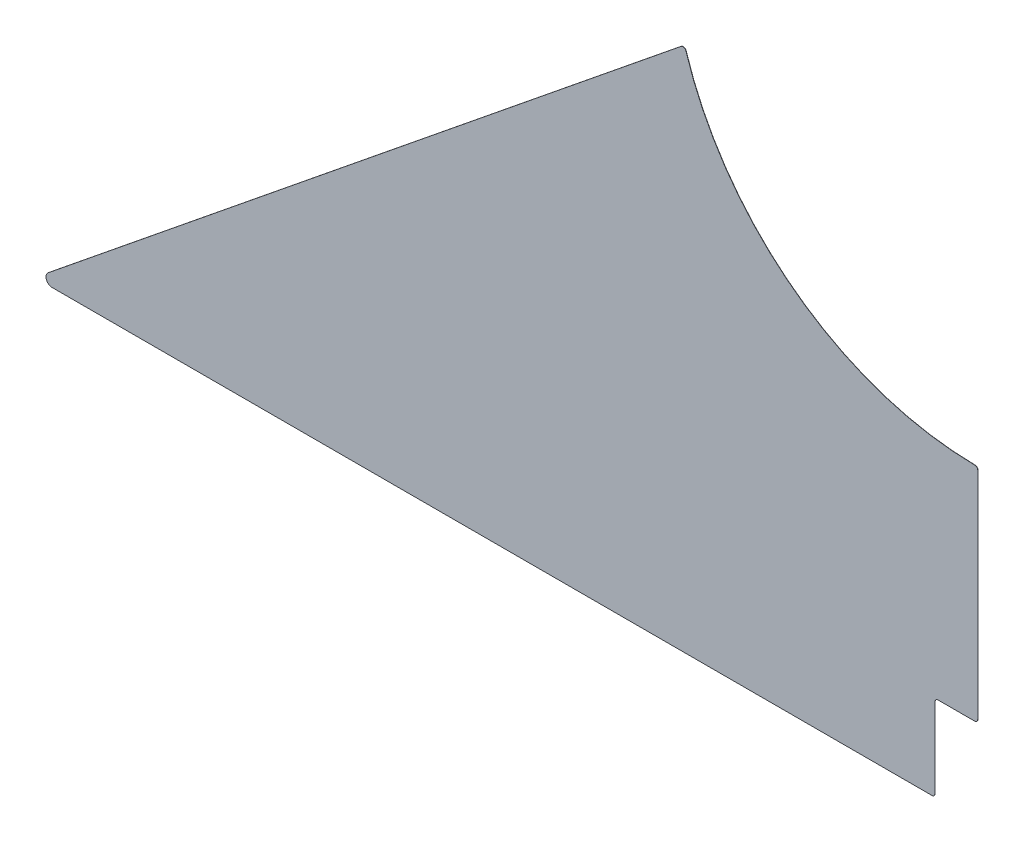
ISO-10303-21;
HEADER;
FILE_DESCRIPTION(('STEP AP214'),'2;1');
FILE_NAME('part.step','',(''),(''),'','','');
FILE_SCHEMA(('AUTOMOTIVE_DESIGN { 1 0 10303 214 1 1 1 1 }'));
ENDSEC;
DATA;
#1=APPLICATION_CONTEXT('core data for automotive mechanical design processes');
#2=APPLICATION_PROTOCOL_DEFINITION('international standard','automotive_design',2000,#1);
#3=PRODUCT_CONTEXT('',#1,'mechanical');
#4=PRODUCT('Part','Part','',(#3));
#5=PRODUCT_RELATED_PRODUCT_CATEGORY('part','',(#4));
#6=PRODUCT_DEFINITION_FORMATION('','',#4);
#7=PRODUCT_DEFINITION_CONTEXT('part definition',#1,'design');
#8=PRODUCT_DEFINITION('design','',#6,#7);
#9=PRODUCT_DEFINITION_SHAPE('','',#8);
#10=(LENGTH_UNIT() NAMED_UNIT(*) SI_UNIT(.MILLI.,.METRE.));
#11=(NAMED_UNIT(*) PLANE_ANGLE_UNIT() SI_UNIT($,.RADIAN.));
#12=(NAMED_UNIT(*) SI_UNIT($,.STERADIAN.) SOLID_ANGLE_UNIT());
#13=UNCERTAINTY_MEASURE_WITH_UNIT(LENGTH_MEASURE(1.E-05),#10,'distance_accuracy_value','');
#14=(GEOMETRIC_REPRESENTATION_CONTEXT(3) GLOBAL_UNCERTAINTY_ASSIGNED_CONTEXT((#13)) GLOBAL_UNIT_ASSIGNED_CONTEXT((#10,
#11,#12)) REPRESENTATION_CONTEXT('',''));
#15=CARTESIAN_POINT('',(0.,0.,0.));
#16=DIRECTION('',(0.,0.,1.));
#17=DIRECTION('',(1.,0.,0.));
#18=AXIS2_PLACEMENT_3D('',#15,#16,#17);
#19=CARTESIAN_POINT('',(-1292.225,-3.17670318081826E-13,1.5875));
#20=DIRECTION('',(0.629320391049834,-0.777145961456974,0.));
#21=DIRECTION('',(0.777145961456974,0.629320391049834,0.));
#22=AXIS2_PLACEMENT_3D('',#19,#20,#21);
#23=PLANE('',#22);
#24=DIRECTION('',(0.,0.,-1.));
#25=VECTOR('',#24,1.);
#26=CARTESIAN_POINT('',(-307.961691260842,797.04071187665,1.5875));
#27=LINE('',#26,#25);
#28=CARTESIAN_POINT('',(-307.961691260842,797.04071187665,1.5875));
#29=VERTEX_POINT('',#28);
#30=CARTESIAN_POINT('',(-307.961691260842,797.04071187665,1.3335));
#31=VERTEX_POINT('',#30);
#32=EDGE_CURVE('E177',#29,#31,#27,.T.);
#33=ORIENTED_EDGE('',*,*,#32,.T.);
#34=DIRECTION('',(-0.777145961456974,-0.629320391049834,0.));
#35=VECTOR('',#34,1.);
#36=CARTESIAN_POINT('',(-1292.225,-3.17658004608335E-13,1.3334999999999));
#37=LINE('',#36,#35);
#38=CARTESIAN_POINT('',(-964.74529205127,265.187838692242,1.33349999999993));
#39=VERTEX_POINT('',#38);
#40=EDGE_CURVE('E194',#31,#39,#37,.T.);
#41=ORIENTED_EDGE('',*,*,#40,.T.);
#42=DIRECTION('',(0.,0.,1.));
#43=VECTOR('',#42,1.);
#44=CARTESIAN_POINT('',(-964.74529205127,265.187838692242,1.5875));
#45=LINE('',#44,#43);
#46=CARTESIAN_POINT('',(-964.74529205127,265.187838692242,1.5875));
#47=VERTEX_POINT('',#46);
#48=EDGE_CURVE('E60',#39,#47,#45,.T.);
#49=ORIENTED_EDGE('',*,*,#48,.T.);
#50=DIRECTION('',(-0.777145961456974,-0.629320391049834,0.));
#51=VECTOR('',#50,1.);
#52=CARTESIAN_POINT('',(-1292.225,-3.17670318081826E-13,1.5875));
#53=LINE('',#52,#51);
#54=EDGE_CURVE('E222',#29,#47,#53,.T.);
#55=ORIENTED_EDGE('',*,*,#54,.F.);
#56=EDGE_LOOP('',(#33,#41,#49,#55));
#57=FACE_BOUND('',#56,.T.);
#58=ADVANCED_FACE('F37',(#57),#23,.F.);
#59=CARTESIAN_POINT('',(0.,890.5875,1.5875));
#60=DIRECTION('',(0.,0.,-1.));
#61=DIRECTION('',(-1.,0.,0.));
#62=AXIS2_PLACEMENT_3D('',#59,#60,#61);
#63=CYLINDRICAL_SURFACE('',#62,317.5);
#64=DIRECTION('',(0.,0.,-1.));
#65=VECTOR('',#64,1.);
#66=CARTESIAN_POINT('',(-3.14356435643564,573.103062581192,1.5875));
#67=LINE('',#66,#65);
#68=CARTESIAN_POINT('',(-3.14356435643564,573.103062581192,1.5875));
#69=VERTEX_POINT('',#68);
#70=CARTESIAN_POINT('',(-3.14356435643564,573.103062581192,1.33349999999997));
#71=VERTEX_POINT('',#70);
#72=EDGE_CURVE('E157',#69,#71,#67,.T.);
#73=ORIENTED_EDGE('',*,*,#72,.T.);
#74=CARTESIAN_POINT('',(0.,890.5875,1.33350000000001));
#75=DIRECTION('',(0.,0.,1.));
#76=DIRECTION('',(0.,-1.,0.));
#77=AXIS2_PLACEMENT_3D('',#74,#75,#76);
#78=CIRCLE('',#77,317.5);
#79=CARTESIAN_POINT('',(-302.934256454712,795.523909355469,1.3335));
#80=VERTEX_POINT('',#79);
#81=EDGE_CURVE('E133',#71,#80,#78,.F.);
#82=ORIENTED_EDGE('',*,*,#81,.T.);
#83=DIRECTION('',(0.,0.,-1.));
#84=VECTOR('',#83,1.);
#85=CARTESIAN_POINT('',(-302.934256454712,795.523909355469,1.5875));
#86=LINE('',#85,#84);
#87=CARTESIAN_POINT('',(-302.934256454712,795.523909355469,1.5875));
#88=VERTEX_POINT('',#87);
#89=EDGE_CURVE('E227',#80,#88,#86,.F.);
#90=ORIENTED_EDGE('',*,*,#89,.T.);
#91=CARTESIAN_POINT('',(0.,890.5875,1.5875));
#92=DIRECTION('',(0.,0.,-1.));
#93=DIRECTION('',(1.,0.,0.));
#94=AXIS2_PLACEMENT_3D('',#91,#92,#93);
#95=CIRCLE('',#94,317.5);
#96=EDGE_CURVE('E224',#69,#88,#95,.T.);
#97=ORIENTED_EDGE('',*,*,#96,.F.);
#98=EDGE_LOOP('',(#73,#82,#90,#97));
#99=FACE_BOUND('',#98,.T.);
#100=ADVANCED_FACE('F230',(#99),#63,.F.);
#101=CARTESIAN_POINT('',(0.,890.5875,1.5875));
#102=DIRECTION('',(0.,0.,1.));
#103=DIRECTION('',(1.,0.,0.));
#104=AXIS2_PLACEMENT_3D('',#101,#102,#103);
#105=PLANE('',#104);
#106=ORIENTED_EDGE('',*,*,#54,.T.);
#107=CARTESIAN_POINT('',(-960.749107568104,260.25296183699,1.5875));
#108=DIRECTION('',(0.,0.,1.));
#109=DIRECTION('',(1.,0.,0.));
#110=AXIS2_PLACEMENT_3D('',#107,#108,#109);
#111=CIRCLE('',#110,6.35);
#112=CARTESIAN_POINT('',(-960.749107568104,253.90296183699,1.5875));
#113=VERTEX_POINT('',#112);
#114=EDGE_CURVE('E52',#47,#113,#111,.T.);
#115=ORIENTED_EDGE('',*,*,#114,.T.);
#116=DIRECTION('',(-1.,0.,0.));
#117=VECTOR('',#116,1.);
#118=CARTESIAN_POINT('',(-44.45,253.902961836991,1.5875));
#119=LINE('',#118,#117);
#120=CARTESIAN_POINT('',(-47.625,253.902961836991,1.5875));
#121=VERTEX_POINT('',#120);
#122=EDGE_CURVE('E190',#121,#113,#119,.T.);
#123=ORIENTED_EDGE('',*,*,#122,.F.);
#124=CARTESIAN_POINT('',(-47.625,257.077961836991,1.5875));
#125=DIRECTION('',(0.,0.,1.));
#126=DIRECTION('',(1.,0.,0.));
#127=AXIS2_PLACEMENT_3D('',#124,#125,#126);
#128=CIRCLE('',#127,3.175);
#129=CARTESIAN_POINT('',(-44.45,257.077961836991,1.5875));
#130=VERTEX_POINT('',#129);
#131=EDGE_CURVE('E155',#121,#130,#128,.T.);
#132=ORIENTED_EDGE('',*,*,#131,.T.);
#133=DIRECTION('',(0.,-1.,0.));
#134=VECTOR('',#133,1.);
#135=CARTESIAN_POINT('',(-44.4499999999999,-3.33066907387547E-13,1.5875));
#136=LINE('',#135,#134);
#137=CARTESIAN_POINT('',(-44.45,339.725,1.5875));
#138=VERTEX_POINT('',#137);
#139=EDGE_CURVE('E216',#138,#130,#136,.T.);
#140=ORIENTED_EDGE('',*,*,#139,.F.);
#141=CARTESIAN_POINT('',(-41.275,339.725,1.5875));
#142=DIRECTION('',(0.,0.,1.));
#143=DIRECTION('',(1.,0.,0.));
#144=AXIS2_PLACEMENT_3D('',#141,#142,#143);
#145=CIRCLE('',#144,3.175);
#146=CARTESIAN_POINT('',(-41.275,342.9,1.5875));
#147=VERTEX_POINT('',#146);
#148=EDGE_CURVE('E180',#138,#147,#145,.F.);
#149=ORIENTED_EDGE('',*,*,#148,.T.);
#150=DIRECTION('',(-1.,0.,0.));
#151=VECTOR('',#150,1.);
#152=CARTESIAN_POINT('',(-44.45,342.9,1.5875));
#153=LINE('',#152,#151);
#154=CARTESIAN_POINT('',(-3.175,342.9,1.5875));
#155=VERTEX_POINT('',#154);
#156=EDGE_CURVE('E219',#155,#147,#153,.T.);
#157=ORIENTED_EDGE('',*,*,#156,.F.);
#158=CARTESIAN_POINT('',(-3.175,346.075,1.5875));
#159=DIRECTION('',(0.,0.,1.));
#160=DIRECTION('',(1.,0.,0.));
#161=AXIS2_PLACEMENT_3D('',#158,#159,#160);
#162=CIRCLE('',#161,3.175);
#163=CARTESIAN_POINT('',(0.,346.075,1.5875));
#164=VERTEX_POINT('',#163);
#165=EDGE_CURVE('E162',#155,#164,#162,.T.);
#166=ORIENTED_EDGE('',*,*,#165,.T.);
#167=DIRECTION('',(0.,-1.,0.));
#168=VECTOR('',#167,1.);
#169=CARTESIAN_POINT('',(0.,0.,1.5875));
#170=LINE('',#169,#168);
#171=CARTESIAN_POINT('',(0.,569.928218207004,1.5875));
#172=VERTEX_POINT('',#171);
#173=EDGE_CURVE('E214',#172,#164,#170,.T.);
#174=ORIENTED_EDGE('',*,*,#173,.F.);
#175=CARTESIAN_POINT('',(-3.175,569.928218207004,1.5875));
#176=DIRECTION('',(0.,0.,1.));
#177=DIRECTION('',(1.,0.,0.));
#178=AXIS2_PLACEMENT_3D('',#175,#176,#177);
#179=CIRCLE('',#178,3.175);
#180=EDGE_CURVE('E152',#172,#69,#179,.T.);
#181=ORIENTED_EDGE('',*,*,#180,.T.);
#182=ORIENTED_EDGE('',*,*,#96,.T.);
#183=CARTESIAN_POINT('',(-305.963599019259,794.573273449024,1.5875));
#184=DIRECTION('',(0.,0.,1.));
#185=DIRECTION('',(1.,0.,0.));
#186=AXIS2_PLACEMENT_3D('',#183,#184,#185);
#187=CIRCLE('',#186,3.175);
#188=EDGE_CURVE('E153',#88,#29,#187,.T.);
#189=ORIENTED_EDGE('',*,*,#188,.T.);
#190=EDGE_LOOP('',(#106,#115,#123,#132,#140,#149,#157,#166,#174,#181,#182,#189));
#191=FACE_BOUND('',#190,.T.);
#192=ADVANCED_FACE('F233',(#191),#105,.T.);
#193=CARTESIAN_POINT('',(-44.4499999999999,-3.33066907387547E-13,0.));
#194=DIRECTION('',(-1.,0.,0.));
#195=DIRECTION('',(0.,-1.,0.));
#196=AXIS2_PLACEMENT_3D('',#193,#194,#195);
#197=PLANE('',#196);
#198=DIRECTION('',(0.,0.,1.));
#199=VECTOR('',#198,1.);
#200=CARTESIAN_POINT('',(-44.45,257.077961836991,0.));
#201=LINE('',#200,#199);
#202=CARTESIAN_POINT('',(-44.45,257.077961836991,1.33349999999993));
#203=VERTEX_POINT('',#202);
#204=EDGE_CURVE('E165',#130,#203,#201,.F.);
#205=ORIENTED_EDGE('',*,*,#204,.T.);
#206=DIRECTION('',(0.,1.,0.));
#207=VECTOR('',#206,1.);
#208=CARTESIAN_POINT('',(-44.4499999999999,-3.33230135994949E-13,1.3334999999999));
#209=LINE('',#208,#207);
#210=CARTESIAN_POINT('',(-44.45,339.725,1.33349999999994));
#211=VERTEX_POINT('',#210);
#212=EDGE_CURVE('E202',#203,#211,#209,.T.);
#213=ORIENTED_EDGE('',*,*,#212,.T.);
#214=DIRECTION('',(0.,0.,1.));
#215=VECTOR('',#214,1.);
#216=CARTESIAN_POINT('',(-44.45,339.725,1.5875));
#217=LINE('',#216,#215);
#218=EDGE_CURVE('E168',#211,#138,#217,.T.);
#219=ORIENTED_EDGE('',*,*,#218,.T.);
#220=ORIENTED_EDGE('',*,*,#139,.T.);
#221=EDGE_LOOP('',(#205,#213,#219,#220));
#222=FACE_BOUND('',#221,.T.);
#223=ADVANCED_FACE('F276',(#222),#197,.F.);
#224=CARTESIAN_POINT('',(-44.45,342.9,0.));
#225=DIRECTION('',(0.,1.,0.));
#226=DIRECTION('',(0.,0.,1.));
#227=AXIS2_PLACEMENT_3D('',#224,#225,#226);
#228=PLANE('',#227);
#229=DIRECTION('',(0.,0.,1.));
#230=VECTOR('',#229,1.);
#231=CARTESIAN_POINT('',(-41.275,342.9,0.));
#232=LINE('',#231,#230);
#233=CARTESIAN_POINT('',(-41.275,342.9,1.33349999999994));
#234=VERTEX_POINT('',#233);
#235=EDGE_CURVE('E172',#147,#234,#232,.F.);
#236=ORIENTED_EDGE('',*,*,#235,.T.);
#237=DIRECTION('',(1.,0.,0.));
#238=VECTOR('',#237,1.);
#239=CARTESIAN_POINT('',(-44.45,342.9,1.33349999999994));
#240=LINE('',#239,#238);
#241=CARTESIAN_POINT('',(-3.175,342.9,1.33349999999994));
#242=VERTEX_POINT('',#241);
#243=EDGE_CURVE('E208',#234,#242,#240,.T.);
#244=ORIENTED_EDGE('',*,*,#243,.T.);
#245=DIRECTION('',(0.,0.,1.));
#246=VECTOR('',#245,1.);
#247=CARTESIAN_POINT('',(-3.175,342.9,0.));
#248=LINE('',#247,#246);
#249=EDGE_CURVE('E170',#242,#155,#248,.T.);
#250=ORIENTED_EDGE('',*,*,#249,.T.);
#251=ORIENTED_EDGE('',*,*,#156,.T.);
#252=EDGE_LOOP('',(#236,#244,#250,#251));
#253=FACE_BOUND('',#252,.T.);
#254=ADVANCED_FACE('F273',(#253),#228,.F.);
#255=CARTESIAN_POINT('',(0.,0.,0.));
#256=DIRECTION('',(-1.,0.,0.));
#257=DIRECTION('',(0.,0.,1.));
#258=AXIS2_PLACEMENT_3D('',#255,#256,#257);
#259=PLANE('',#258);
#260=DIRECTION('',(0.,0.,1.));
#261=VECTOR('',#260,1.);
#262=CARTESIAN_POINT('',(0.,346.075,0.));
#263=LINE('',#262,#261);
#264=CARTESIAN_POINT('',(0.,346.075,1.33349999999994));
#265=VERTEX_POINT('',#264);
#266=EDGE_CURVE('E147',#164,#265,#263,.F.);
#267=ORIENTED_EDGE('',*,*,#266,.T.);
#268=DIRECTION('',(0.,-1.,0.));
#269=VECTOR('',#268,1.);
#270=CARTESIAN_POINT('',(0.,797.748273449024,1.3335));
#271=LINE('',#270,#269);
#272=CARTESIAN_POINT('',(0.,569.928218207004,1.33349999999997));
#273=VERTEX_POINT('',#272);
#274=EDGE_CURVE('E130',#273,#265,#271,.T.);
#275=ORIENTED_EDGE('',*,*,#274,.F.);
#276=DIRECTION('',(0.,0.,-1.));
#277=VECTOR('',#276,1.);
#278=CARTESIAN_POINT('',(0.,569.928218207004,0.));
#279=LINE('',#278,#277);
#280=EDGE_CURVE('E144',#273,#172,#279,.F.);
#281=ORIENTED_EDGE('',*,*,#280,.T.);
#282=ORIENTED_EDGE('',*,*,#173,.T.);
#283=EDGE_LOOP('',(#267,#275,#281,#282));
#284=FACE_BOUND('',#283,.T.);
#285=ADVANCED_FACE('F142',(#284),#259,.F.);
#286=CARTESIAN_POINT('',(-44.45,253.902961836991,0.));
#287=DIRECTION('',(0.,1.,0.));
#288=DIRECTION('',(-1.,0.,0.));
#289=AXIS2_PLACEMENT_3D('',#286,#287,#288);
#290=PLANE('',#289);
#291=DIRECTION('',(0.,0.,1.));
#292=VECTOR('',#291,1.);
#293=CARTESIAN_POINT('',(-960.749107568104,253.90296183699,0.));
#294=LINE('',#293,#292);
#295=CARTESIAN_POINT('',(-960.749107568104,253.902961836991,1.33349999999993));
#296=VERTEX_POINT('',#295);
#297=EDGE_CURVE('E45',#113,#296,#294,.F.);
#298=ORIENTED_EDGE('',*,*,#297,.T.);
#299=DIRECTION('',(1.,0.,0.));
#300=VECTOR('',#299,1.);
#301=CARTESIAN_POINT('',(-967.099107568104,253.902961836991,1.33349999999993));
#302=LINE('',#301,#300);
#303=CARTESIAN_POINT('',(-47.625,253.902961836991,1.33349999999993));
#304=VERTEX_POINT('',#303);
#305=EDGE_CURVE('E148',#296,#304,#302,.T.);
#306=ORIENTED_EDGE('',*,*,#305,.T.);
#307=DIRECTION('',(0.,0.,1.));
#308=VECTOR('',#307,1.);
#309=CARTESIAN_POINT('',(-47.625,253.902961836991,0.));
#310=LINE('',#309,#308);
#311=EDGE_CURVE('E175',#304,#121,#310,.T.);
#312=ORIENTED_EDGE('',*,*,#311,.T.);
#313=ORIENTED_EDGE('',*,*,#122,.T.);
#314=EDGE_LOOP('',(#298,#306,#312,#313));
#315=FACE_BOUND('',#314,.T.);
#316=ADVANCED_FACE('F187',(#315),#290,.F.);
#317=CARTESIAN_POINT('',(-3.175,569.928218207004,1.5875));
#318=DIRECTION('',(0.,0.,-1.));
#319=DIRECTION('',(-1.,0.,0.));
#320=AXIS2_PLACEMENT_3D('',#317,#318,#319);
#321=CYLINDRICAL_SURFACE('',#320,3.175);
#322=CARTESIAN_POINT('',(-3.175,569.928218207004,1.33349999999997));
#323=DIRECTION('',(0.,0.,1.));
#324=DIRECTION('',(0.,-1.,0.));
#325=AXIS2_PLACEMENT_3D('',#322,#323,#324);
#326=CIRCLE('',#325,3.175);
#327=EDGE_CURVE('E127',#71,#273,#326,.F.);
#328=ORIENTED_EDGE('',*,*,#327,.F.);
#329=ORIENTED_EDGE('',*,*,#72,.F.);
#330=ORIENTED_EDGE('',*,*,#180,.F.);
#331=ORIENTED_EDGE('',*,*,#280,.F.);
#332=EDGE_LOOP('',(#328,#329,#330,#331));
#333=FACE_BOUND('',#332,.T.);
#334=ADVANCED_FACE('F151',(#333),#321,.T.);
#335=CARTESIAN_POINT('',(-41.275,339.725,0.));
#336=DIRECTION('',(0.,0.,-1.));
#337=DIRECTION('',(-1.,0.,0.));
#338=AXIS2_PLACEMENT_3D('',#335,#336,#337);
#339=CYLINDRICAL_SURFACE('',#338,3.175);
#340=ORIENTED_EDGE('',*,*,#218,.F.);
#341=CARTESIAN_POINT('',(-41.275,339.725,1.33349999999994));
#342=DIRECTION('',(0.,0.,1.));
#343=DIRECTION('',(0.,-1.,0.));
#344=AXIS2_PLACEMENT_3D('',#341,#342,#343);
#345=CIRCLE('',#344,3.175);
#346=EDGE_CURVE('E205',#211,#234,#345,.F.);
#347=ORIENTED_EDGE('',*,*,#346,.T.);
#348=ORIENTED_EDGE('',*,*,#235,.F.);
#349=ORIENTED_EDGE('',*,*,#148,.F.);
#350=EDGE_LOOP('',(#340,#347,#348,#349));
#351=FACE_BOUND('',#350,.T.);
#352=ADVANCED_FACE('F247',(#351),#339,.F.);
#353=CARTESIAN_POINT('',(-3.175,346.075,0.));
#354=DIRECTION('',(0.,0.,1.));
#355=DIRECTION('',(1.,0.,0.));
#356=AXIS2_PLACEMENT_3D('',#353,#354,#355);
#357=CYLINDRICAL_SURFACE('',#356,3.175);
#358=CARTESIAN_POINT('',(-3.175,346.075,1.33349999999994));
#359=DIRECTION('',(0.,0.,1.));
#360=DIRECTION('',(0.,-1.,0.));
#361=AXIS2_PLACEMENT_3D('',#358,#359,#360);
#362=CIRCLE('',#361,3.175);
#363=EDGE_CURVE('E211',#265,#242,#362,.F.);
#364=ORIENTED_EDGE('',*,*,#363,.F.);
#365=ORIENTED_EDGE('',*,*,#266,.F.);
#366=ORIENTED_EDGE('',*,*,#165,.F.);
#367=ORIENTED_EDGE('',*,*,#249,.F.);
#368=EDGE_LOOP('',(#364,#365,#366,#367));
#369=FACE_BOUND('',#368,.T.);
#370=ADVANCED_FACE('F250',(#369),#357,.T.);
#371=CARTESIAN_POINT('',(-47.625,257.077961836991,0.));
#372=DIRECTION('',(0.,0.,1.));
#373=DIRECTION('',(1.,0.,0.));
#374=AXIS2_PLACEMENT_3D('',#371,#372,#373);
#375=CYLINDRICAL_SURFACE('',#374,3.175);
#376=CARTESIAN_POINT('',(-47.625,257.077961836991,1.33349999999993));
#377=DIRECTION('',(0.,0.,1.));
#378=DIRECTION('',(0.,-1.,0.));
#379=AXIS2_PLACEMENT_3D('',#376,#377,#378);
#380=CIRCLE('',#379,3.175);
#381=EDGE_CURVE('E138',#203,#304,#380,.F.);
#382=ORIENTED_EDGE('',*,*,#381,.F.);
#383=ORIENTED_EDGE('',*,*,#204,.F.);
#384=ORIENTED_EDGE('',*,*,#131,.F.);
#385=ORIENTED_EDGE('',*,*,#311,.F.);
#386=EDGE_LOOP('',(#382,#383,#384,#385));
#387=FACE_BOUND('',#386,.T.);
#388=ADVANCED_FACE('F254',(#387),#375,.T.);
#389=CARTESIAN_POINT('',(-305.963599019259,794.573273449024,1.5875));
#390=DIRECTION('',(0.,0.,-1.));
#391=DIRECTION('',(-1.,0.,0.));
#392=AXIS2_PLACEMENT_3D('',#389,#390,#391);
#393=CYLINDRICAL_SURFACE('',#392,3.175);
#394=CARTESIAN_POINT('',(-305.963599019259,794.573273449024,1.3335));
#395=DIRECTION('',(0.,0.,1.));
#396=DIRECTION('',(0.,-1.,0.));
#397=AXIS2_PLACEMENT_3D('',#394,#395,#396);
#398=CIRCLE('',#397,3.175);
#399=EDGE_CURVE('E196',#31,#80,#398,.F.);
#400=ORIENTED_EDGE('',*,*,#399,.F.);
#401=ORIENTED_EDGE('',*,*,#32,.F.);
#402=ORIENTED_EDGE('',*,*,#188,.F.);
#403=ORIENTED_EDGE('',*,*,#89,.F.);
#404=EDGE_LOOP('',(#400,#401,#402,#403));
#405=FACE_BOUND('',#404,.T.);
#406=ADVANCED_FACE('F236',(#405),#393,.T.);
#407=CARTESIAN_POINT('',(-960.749107568104,260.25296183699,1.5875));
#408=DIRECTION('',(0.,0.,1.));
#409=DIRECTION('',(1.,0.,0.));
#410=AXIS2_PLACEMENT_3D('',#407,#408,#409);
#411=CYLINDRICAL_SURFACE('',#410,6.35);
#412=CARTESIAN_POINT('',(-960.749107568104,260.25296183699,1.33349999999993));
#413=DIRECTION('',(0.,0.,1.));
#414=DIRECTION('',(0.,-1.,0.));
#415=AXIS2_PLACEMENT_3D('',#412,#413,#414);
#416=CIRCLE('',#415,6.35);
#417=EDGE_CURVE('E11',#296,#39,#416,.F.);
#418=ORIENTED_EDGE('',*,*,#417,.F.);
#419=ORIENTED_EDGE('',*,*,#297,.F.);
#420=ORIENTED_EDGE('',*,*,#114,.F.);
#421=ORIENTED_EDGE('',*,*,#48,.F.);
#422=EDGE_LOOP('',(#418,#419,#420,#421));
#423=FACE_BOUND('',#422,.T.);
#424=ADVANCED_FACE('F39',(#423),#411,.T.);
#425=CARTESIAN_POINT('',(-967.099107568104,797.748273449024,1.3335));
#426=DIRECTION('',(0.,0.,1.));
#427=DIRECTION('',(0.,-1.,0.));
#428=AXIS2_PLACEMENT_3D('',#425,#426,#427);
#429=PLANE('',#428);
#430=ORIENTED_EDGE('',*,*,#363,.T.);
#431=ORIENTED_EDGE('',*,*,#243,.F.);
#432=ORIENTED_EDGE('',*,*,#346,.F.);
#433=ORIENTED_EDGE('',*,*,#212,.F.);
#434=ORIENTED_EDGE('',*,*,#381,.T.);
#435=ORIENTED_EDGE('',*,*,#305,.F.);
#436=ORIENTED_EDGE('',*,*,#417,.T.);
#437=ORIENTED_EDGE('',*,*,#40,.F.);
#438=ORIENTED_EDGE('',*,*,#399,.T.);
#439=ORIENTED_EDGE('',*,*,#81,.F.);
#440=ORIENTED_EDGE('',*,*,#327,.T.);
#441=ORIENTED_EDGE('',*,*,#274,.T.);
#442=EDGE_LOOP('',(#430,#431,#432,#433,#434,#435,#436,#437,#438,#439,#440,#441));
#443=FACE_BOUND('',#442,.T.);
#444=ADVANCED_FACE('F129',(#443),#429,.F.);
#445=CLOSED_SHELL('',(#58,#100,#192,#223,#254,#285,#316,#334,#352,#370,#388,#406,#424,#444));
#446=MANIFOLD_SOLID_BREP('B2',#445);
#447=ADVANCED_BREP_SHAPE_REPRESENTATION('',(#18,#446),#14);
#448=SHAPE_DEFINITION_REPRESENTATION(#9,#447);
ENDSEC;
END-ISO-10303-21;
